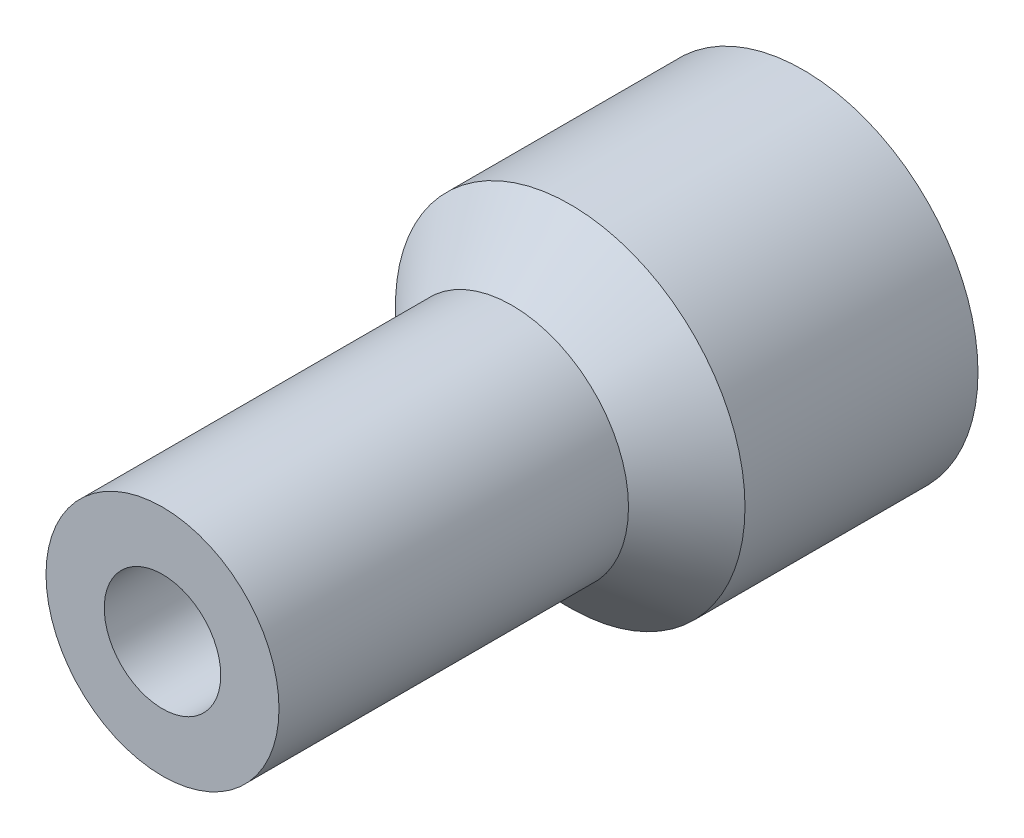
ISO-10303-21;
HEADER;
FILE_DESCRIPTION(('STEP AP214'),'2;1');
FILE_NAME('part.step','',(''),(''),'','','');
FILE_SCHEMA(('AUTOMOTIVE_DESIGN { 1 0 10303 214 1 1 1 1 }'));
ENDSEC;
DATA;
#1=APPLICATION_CONTEXT('core data for automotive mechanical design processes');
#2=APPLICATION_PROTOCOL_DEFINITION('international standard','automotive_design',2000,#1);
#3=PRODUCT_CONTEXT('',#1,'mechanical');
#4=PRODUCT('Part','Part','',(#3));
#5=PRODUCT_RELATED_PRODUCT_CATEGORY('part','',(#4));
#6=PRODUCT_DEFINITION_FORMATION('','',#4);
#7=PRODUCT_DEFINITION_CONTEXT('part definition',#1,'design');
#8=PRODUCT_DEFINITION('design','',#6,#7);
#9=PRODUCT_DEFINITION_SHAPE('','',#8);
#10=(LENGTH_UNIT() NAMED_UNIT(*) SI_UNIT(.MILLI.,.METRE.));
#11=(NAMED_UNIT(*) PLANE_ANGLE_UNIT() SI_UNIT($,.RADIAN.));
#12=(NAMED_UNIT(*) SI_UNIT($,.STERADIAN.) SOLID_ANGLE_UNIT());
#13=UNCERTAINTY_MEASURE_WITH_UNIT(LENGTH_MEASURE(1.E-05),#10,'distance_accuracy_value','');
#14=(GEOMETRIC_REPRESENTATION_CONTEXT(3) GLOBAL_UNCERTAINTY_ASSIGNED_CONTEXT((#13)) GLOBAL_UNIT_ASSIGNED_CONTEXT((#10,
#11,#12)) REPRESENTATION_CONTEXT('',''));
#15=CARTESIAN_POINT('',(0.,0.,0.));
#16=DIRECTION('',(0.,0.,1.));
#17=DIRECTION('',(1.,0.,0.));
#18=AXIS2_PLACEMENT_3D('',#15,#16,#17);
#19=CARTESIAN_POINT('',(0.,0.,4.));
#20=DIRECTION('',(0.,0.,-1.));
#21=DIRECTION('',(-1.,0.,0.));
#22=AXIS2_PLACEMENT_3D('',#19,#20,#21);
#23=CYLINDRICAL_SURFACE('',#22,3.);
#24=CARTESIAN_POINT('',(0.,0.,4.));
#25=DIRECTION('',(0.,0.,1.));
#26=DIRECTION('',(1.,0.,0.));
#27=AXIS2_PLACEMENT_3D('',#24,#25,#26);
#28=CIRCLE('',#27,3.);
#29=CARTESIAN_POINT('',(3.,0.,4.));
#30=VERTEX_POINT('',#29);
#31=EDGE_CURVE('E54',#30,#30,#28,.T.);
#32=ORIENTED_EDGE('',*,*,#31,.F.);
#33=EDGE_LOOP('',(#32));
#34=FACE_BOUND('',#33,.T.);
#35=CARTESIAN_POINT('',(0.,0.,0.));
#36=DIRECTION('',(0.,0.,1.));
#37=DIRECTION('',(1.,0.,0.));
#38=AXIS2_PLACEMENT_3D('',#35,#36,#37);
#39=CIRCLE('',#38,3.);
#40=CARTESIAN_POINT('',(3.,0.,0.));
#41=VERTEX_POINT('',#40);
#42=EDGE_CURVE('E59',#41,#41,#39,.T.);
#43=ORIENTED_EDGE('',*,*,#42,.T.);
#44=EDGE_LOOP('',(#43));
#45=FACE_BOUND('',#44,.T.);
#46=ADVANCED_FACE('F45',(#34,#45),#23,.T.);
#47=CARTESIAN_POINT('',(0.,0.,0.));
#48=DIRECTION('',(0.,0.,1.));
#49=DIRECTION('',(1.,0.,0.));
#50=AXIS2_PLACEMENT_3D('',#47,#48,#49);
#51=PLANE('',#50);
#52=ORIENTED_EDGE('',*,*,#42,.F.);
#53=EDGE_LOOP('',(#52));
#54=FACE_BOUND('',#53,.T.);
#55=CARTESIAN_POINT('',(0.,0.,0.));
#56=DIRECTION('',(0.,0.,1.));
#57=DIRECTION('',(1.,0.,0.));
#58=AXIS2_PLACEMENT_3D('',#55,#56,#57);
#59=CIRCLE('',#58,1.);
#60=CARTESIAN_POINT('',(1.,0.,0.));
#61=VERTEX_POINT('',#60);
#62=EDGE_CURVE('E67',#61,#61,#59,.T.);
#63=ORIENTED_EDGE('',*,*,#62,.T.);
#64=EDGE_LOOP('',(#63));
#65=FACE_BOUND('',#64,.T.);
#66=ADVANCED_FACE('F95',(#54,#65),#51,.F.);
#67=CARTESIAN_POINT('',(0.,0.,11.));
#68=DIRECTION('',(0.,0.,-1.));
#69=DIRECTION('',(-1.,0.,0.));
#70=AXIS2_PLACEMENT_3D('',#67,#68,#69);
#71=CYLINDRICAL_SURFACE('',#70,1.);
#72=CARTESIAN_POINT('',(0.,0.,11.));
#73=DIRECTION('',(0.,0.,1.));
#74=DIRECTION('',(1.,0.,0.));
#75=AXIS2_PLACEMENT_3D('',#72,#73,#74);
#76=CIRCLE('',#75,1.);
#77=CARTESIAN_POINT('',(1.,0.,11.));
#78=VERTEX_POINT('',#77);
#79=EDGE_CURVE('E71',#78,#78,#76,.T.);
#80=ORIENTED_EDGE('',*,*,#79,.T.);
#81=EDGE_LOOP('',(#80));
#82=FACE_BOUND('',#81,.T.);
#83=ORIENTED_EDGE('',*,*,#62,.F.);
#84=EDGE_LOOP('',(#83));
#85=FACE_BOUND('',#84,.T.);
#86=ADVANCED_FACE('F79',(#82,#85),#71,.F.);
#87=CARTESIAN_POINT('',(0.,0.,11.));
#88=DIRECTION('',(0.,0.,-1.));
#89=DIRECTION('',(-1.,0.,0.));
#90=AXIS2_PLACEMENT_3D('',#87,#88,#89);
#91=CYLINDRICAL_SURFACE('',#90,2.);
#92=CARTESIAN_POINT('',(0.,0.,5.00000000000001));
#93=DIRECTION('',(0.,0.,1.));
#94=DIRECTION('',(1.,0.,0.));
#95=AXIS2_PLACEMENT_3D('',#92,#93,#94);
#96=CIRCLE('',#95,2.);
#97=CARTESIAN_POINT('',(2.,0.,5.00000000000001));
#98=VERTEX_POINT('',#97);
#99=EDGE_CURVE('E10',#98,#98,#96,.T.);
#100=ORIENTED_EDGE('',*,*,#99,.T.);
#101=EDGE_LOOP('',(#100));
#102=FACE_BOUND('',#101,.T.);
#103=CARTESIAN_POINT('',(0.,0.,11.));
#104=DIRECTION('',(0.,0.,1.));
#105=DIRECTION('',(1.,0.,0.));
#106=AXIS2_PLACEMENT_3D('',#103,#104,#105);
#107=CIRCLE('',#106,2.);
#108=CARTESIAN_POINT('',(2.,0.,11.));
#109=VERTEX_POINT('',#108);
#110=EDGE_CURVE('E65',#109,#109,#107,.T.);
#111=ORIENTED_EDGE('',*,*,#110,.F.);
#112=EDGE_LOOP('',(#111));
#113=FACE_BOUND('',#112,.T.);
#114=ADVANCED_FACE('F85',(#102,#113),#91,.T.);
#115=CARTESIAN_POINT('',(0.,0.,11.));
#116=DIRECTION('',(0.,0.,1.));
#117=DIRECTION('',(1.,0.,0.));
#118=AXIS2_PLACEMENT_3D('',#115,#116,#117);
#119=PLANE('',#118);
#120=ORIENTED_EDGE('',*,*,#79,.F.);
#121=EDGE_LOOP('',(#120));
#122=FACE_BOUND('',#121,.T.);
#123=ORIENTED_EDGE('',*,*,#110,.T.);
#124=EDGE_LOOP('',(#123));
#125=FACE_BOUND('',#124,.T.);
#126=ADVANCED_FACE('F82',(#122,#125),#119,.T.);
#127=CARTESIAN_POINT('',(0.,0.,5.00000000000001));
#128=DIRECTION('',(0.,0.,-1.));
#129=DIRECTION('',(-1.,0.,0.));
#130=AXIS2_PLACEMENT_3D('',#127,#128,#129);
#131=CONICAL_SURFACE('',#130,2.,0.785398163397443);
#132=ORIENTED_EDGE('',*,*,#31,.T.);
#133=EDGE_LOOP('',(#132));
#134=FACE_BOUND('',#133,.T.);
#135=ORIENTED_EDGE('',*,*,#99,.F.);
#136=EDGE_LOOP('',(#135));
#137=FACE_BOUND('',#136,.T.);
#138=ADVANCED_FACE('F48',(#134,#137),#131,.T.);
#139=CLOSED_SHELL('',(#46,#66,#86,#114,#126,#138));
#140=MANIFOLD_SOLID_BREP('B2',#139);
#141=ADVANCED_BREP_SHAPE_REPRESENTATION('',(#18,#140),#14);
#142=SHAPE_DEFINITION_REPRESENTATION(#9,#141);
ENDSEC;
END-ISO-10303-21;
